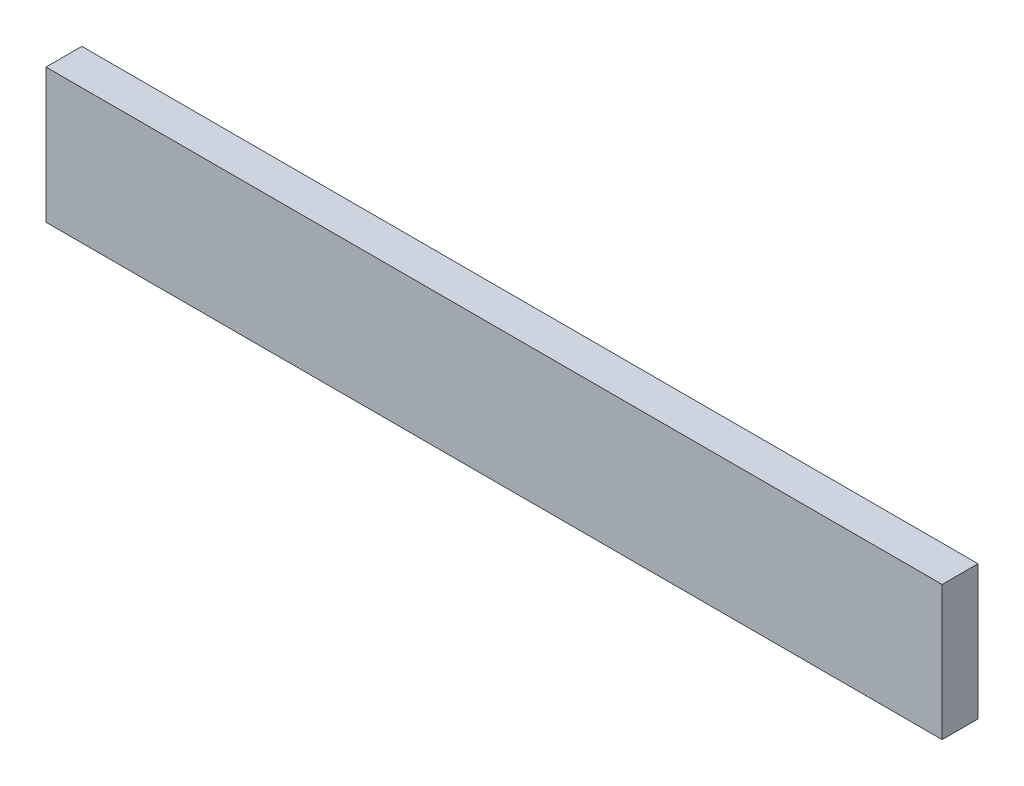
ISO-10303-21;
HEADER;
FILE_DESCRIPTION(('STEP AP214'),'2;1');
FILE_NAME('part.step','',(''),(''),'','','');
FILE_SCHEMA(('AUTOMOTIVE_DESIGN { 1 0 10303 214 1 1 1 1 }'));
ENDSEC;
DATA;
#1=APPLICATION_CONTEXT('core data for automotive mechanical design processes');
#2=APPLICATION_PROTOCOL_DEFINITION('international standard','automotive_design',2000,#1);
#3=PRODUCT_CONTEXT('',#1,'mechanical');
#4=PRODUCT('Part','Part','',(#3));
#5=PRODUCT_RELATED_PRODUCT_CATEGORY('part','',(#4));
#6=PRODUCT_DEFINITION_FORMATION('','',#4);
#7=PRODUCT_DEFINITION_CONTEXT('part definition',#1,'design');
#8=PRODUCT_DEFINITION('design','',#6,#7);
#9=PRODUCT_DEFINITION_SHAPE('','',#8);
#10=(LENGTH_UNIT() NAMED_UNIT(*) SI_UNIT(.MILLI.,.METRE.));
#11=(NAMED_UNIT(*) PLANE_ANGLE_UNIT() SI_UNIT($,.RADIAN.));
#12=(NAMED_UNIT(*) SI_UNIT($,.STERADIAN.) SOLID_ANGLE_UNIT());
#13=UNCERTAINTY_MEASURE_WITH_UNIT(LENGTH_MEASURE(1.E-05),#10,'distance_accuracy_value','');
#14=(GEOMETRIC_REPRESENTATION_CONTEXT(3) GLOBAL_UNCERTAINTY_ASSIGNED_CONTEXT((#13)) GLOBAL_UNIT_ASSIGNED_CONTEXT((#10,
#11,#12)) REPRESENTATION_CONTEXT('',''));
#15=CARTESIAN_POINT('',(0.,0.,0.));
#16=DIRECTION('',(0.,0.,1.));
#17=DIRECTION('',(1.,0.,0.));
#18=AXIS2_PLACEMENT_3D('',#15,#16,#17);
#19=CARTESIAN_POINT('',(0.,0.,0.));
#20=DIRECTION('',(0.,0.,-1.));
#21=DIRECTION('',(-1.,0.,0.));
#22=AXIS2_PLACEMENT_3D('',#19,#20,#21);
#23=PLANE('',#22);
#24=CARTESIAN_POINT('',(48.26,3.81,0.));
#25=DIRECTION('',(0.,0.,-1.));
#26=DIRECTION('',(-1.,0.,0.));
#27=AXIS2_PLACEMENT_3D('',#24,#25,#26);
#28=CIRCLE('',#27,2.54);
#29=CARTESIAN_POINT('',(45.72,3.81,0.));
#30=VERTEX_POINT('',#29);
#31=EDGE_CURVE('E122',#30,#30,#28,.T.);
#32=ORIENTED_EDGE('',*,*,#31,.F.);
#33=EDGE_LOOP('',(#32));
#34=FACE_BOUND('',#33,.T.);
#35=CARTESIAN_POINT('',(109.22,3.81,0.));
#36=DIRECTION('',(0.,0.,-1.));
#37=DIRECTION('',(-1.,0.,0.));
#38=AXIS2_PLACEMENT_3D('',#35,#36,#37);
#39=CIRCLE('',#38,2.54);
#40=CARTESIAN_POINT('',(106.68,3.81,0.));
#41=VERTEX_POINT('',#40);
#42=EDGE_CURVE('E110',#41,#41,#39,.T.);
#43=ORIENTED_EDGE('',*,*,#42,.F.);
#44=EDGE_LOOP('',(#43));
#45=FACE_BOUND('',#44,.T.);
#46=DIRECTION('',(0.,-1.,0.));
#47=VECTOR('',#46,1.);
#48=CARTESIAN_POINT('',(0.,0.,0.));
#49=LINE('',#48,#47);
#50=CARTESIAN_POINT('',(0.,19.05,0.));
#51=VERTEX_POINT('',#50);
#52=CARTESIAN_POINT('',(0.,0.,0.));
#53=VERTEX_POINT('',#52);
#54=EDGE_CURVE('E96',#51,#53,#49,.T.);
#55=ORIENTED_EDGE('',*,*,#54,.F.);
#56=DIRECTION('',(-1.,0.,0.));
#57=VECTOR('',#56,1.);
#58=CARTESIAN_POINT('',(0.,19.05,0.));
#59=LINE('',#58,#57);
#60=CARTESIAN_POINT('',(127.,19.05,0.));
#61=VERTEX_POINT('',#60);
#62=EDGE_CURVE('E72',#61,#51,#59,.T.);
#63=ORIENTED_EDGE('',*,*,#62,.F.);
#64=DIRECTION('',(0.,1.,0.));
#65=VECTOR('',#64,1.);
#66=CARTESIAN_POINT('',(127.,0.,0.));
#67=LINE('',#66,#65);
#68=CARTESIAN_POINT('',(127.,0.,0.));
#69=VERTEX_POINT('',#68);
#70=EDGE_CURVE('E66',#69,#61,#67,.T.);
#71=ORIENTED_EDGE('',*,*,#70,.F.);
#72=DIRECTION('',(1.,0.,0.));
#73=VECTOR('',#72,1.);
#74=CARTESIAN_POINT('',(0.,0.,0.));
#75=LINE('',#74,#73);
#76=EDGE_CURVE('E88',#53,#69,#75,.T.);
#77=ORIENTED_EDGE('',*,*,#76,.F.);
#78=EDGE_LOOP('',(#55,#63,#71,#77));
#79=FACE_BOUND('',#78,.T.);
#80=CARTESIAN_POINT('',(78.74,3.80999999999999,0.));
#81=DIRECTION('',(0.,0.,-1.));
#82=DIRECTION('',(-1.,0.,0.));
#83=AXIS2_PLACEMENT_3D('',#80,#81,#82);
#84=CIRCLE('',#83,2.54);
#85=CARTESIAN_POINT('',(76.2,3.80999999999999,0.));
#86=VERTEX_POINT('',#85);
#87=EDGE_CURVE('E116',#86,#86,#84,.T.);
#88=ORIENTED_EDGE('',*,*,#87,.F.);
#89=EDGE_LOOP('',(#88));
#90=FACE_BOUND('',#89,.T.);
#91=CARTESIAN_POINT('',(17.78,3.81,0.));
#92=DIRECTION('',(0.,0.,-1.));
#93=DIRECTION('',(-1.,0.,0.));
#94=AXIS2_PLACEMENT_3D('',#91,#92,#93);
#95=CIRCLE('',#94,2.54);
#96=CARTESIAN_POINT('',(15.24,3.81,0.));
#97=VERTEX_POINT('',#96);
#98=EDGE_CURVE('E128',#97,#97,#95,.T.);
#99=ORIENTED_EDGE('',*,*,#98,.F.);
#100=EDGE_LOOP('',(#99));
#101=FACE_BOUND('',#100,.T.);
#102=ADVANCED_FACE('F32',(#34,#45,#79,#90,#101),#23,.T.);
#103=CARTESIAN_POINT('',(0.,0.,5.08));
#104=DIRECTION('',(1.,0.,0.));
#105=DIRECTION('',(0.,0.,-1.));
#106=AXIS2_PLACEMENT_3D('',#103,#104,#105);
#107=PLANE('',#106);
#108=ORIENTED_EDGE('',*,*,#54,.T.);
#109=DIRECTION('',(0.,0.,-1.));
#110=VECTOR('',#109,1.);
#111=CARTESIAN_POINT('',(0.,0.,5.08));
#112=LINE('',#111,#110);
#113=CARTESIAN_POINT('',(0.,0.,5.08));
#114=VERTEX_POINT('',#113);
#115=EDGE_CURVE('E11',#114,#53,#112,.T.);
#116=ORIENTED_EDGE('',*,*,#115,.F.);
#117=DIRECTION('',(0.,-1.,0.));
#118=VECTOR('',#117,1.);
#119=CARTESIAN_POINT('',(0.,0.,5.08));
#120=LINE('',#119,#118);
#121=CARTESIAN_POINT('',(0.,19.05,5.08));
#122=VERTEX_POINT('',#121);
#123=EDGE_CURVE('E84',#122,#114,#120,.T.);
#124=ORIENTED_EDGE('',*,*,#123,.F.);
#125=DIRECTION('',(0.,0.,-1.));
#126=VECTOR('',#125,1.);
#127=CARTESIAN_POINT('',(0.,19.05,5.08));
#128=LINE('',#127,#126);
#129=EDGE_CURVE('E92',#122,#51,#128,.T.);
#130=ORIENTED_EDGE('',*,*,#129,.T.);
#131=EDGE_LOOP('',(#108,#116,#124,#130));
#132=FACE_BOUND('',#131,.T.);
#133=ADVANCED_FACE('F34',(#132),#107,.F.);
#134=CARTESIAN_POINT('',(0.,0.,5.08));
#135=DIRECTION('',(0.,1.,0.));
#136=DIRECTION('',(0.,0.,1.));
#137=AXIS2_PLACEMENT_3D('',#134,#135,#136);
#138=PLANE('',#137);
#139=ORIENTED_EDGE('',*,*,#76,.T.);
#140=DIRECTION('',(0.,0.,-1.));
#141=VECTOR('',#140,1.);
#142=CARTESIAN_POINT('',(127.,0.,5.08));
#143=LINE('',#142,#141);
#144=CARTESIAN_POINT('',(127.,0.,5.08));
#145=VERTEX_POINT('',#144);
#146=EDGE_CURVE('E41',#145,#69,#143,.T.);
#147=ORIENTED_EDGE('',*,*,#146,.F.);
#148=DIRECTION('',(1.,0.,0.));
#149=VECTOR('',#148,1.);
#150=CARTESIAN_POINT('',(0.,0.,5.08));
#151=LINE('',#150,#149);
#152=EDGE_CURVE('E79',#114,#145,#151,.T.);
#153=ORIENTED_EDGE('',*,*,#152,.F.);
#154=ORIENTED_EDGE('',*,*,#115,.T.);
#155=EDGE_LOOP('',(#139,#147,#153,#154));
#156=FACE_BOUND('',#155,.T.);
#157=ADVANCED_FACE('F87',(#156),#138,.F.);
#158=CARTESIAN_POINT('',(127.,0.,5.08));
#159=DIRECTION('',(-1.,0.,0.));
#160=DIRECTION('',(0.,0.,1.));
#161=AXIS2_PLACEMENT_3D('',#158,#159,#160);
#162=PLANE('',#161);
#163=ORIENTED_EDGE('',*,*,#70,.T.);
#164=DIRECTION('',(0.,0.,-1.));
#165=VECTOR('',#164,1.);
#166=CARTESIAN_POINT('',(127.,19.05,5.08));
#167=LINE('',#166,#165);
#168=CARTESIAN_POINT('',(127.,19.05,5.08));
#169=VERTEX_POINT('',#168);
#170=EDGE_CURVE('E89',#169,#61,#167,.T.);
#171=ORIENTED_EDGE('',*,*,#170,.F.);
#172=DIRECTION('',(0.,1.,0.));
#173=VECTOR('',#172,1.);
#174=CARTESIAN_POINT('',(127.,0.,5.08));
#175=LINE('',#174,#173);
#176=EDGE_CURVE('E82',#145,#169,#175,.T.);
#177=ORIENTED_EDGE('',*,*,#176,.F.);
#178=ORIENTED_EDGE('',*,*,#146,.T.);
#179=EDGE_LOOP('',(#163,#171,#177,#178));
#180=FACE_BOUND('',#179,.T.);
#181=ADVANCED_FACE('F90',(#180),#162,.F.);
#182=CARTESIAN_POINT('',(0.,19.05,5.08));
#183=DIRECTION('',(0.,-1.,0.));
#184=DIRECTION('',(0.,0.,-1.));
#185=AXIS2_PLACEMENT_3D('',#182,#183,#184);
#186=PLANE('',#185);
#187=ORIENTED_EDGE('',*,*,#62,.T.);
#188=ORIENTED_EDGE('',*,*,#129,.F.);
#189=DIRECTION('',(-1.,0.,0.));
#190=VECTOR('',#189,1.);
#191=CARTESIAN_POINT('',(0.,19.05,5.08));
#192=LINE('',#191,#190);
#193=EDGE_CURVE('E49',#169,#122,#192,.T.);
#194=ORIENTED_EDGE('',*,*,#193,.F.);
#195=ORIENTED_EDGE('',*,*,#170,.T.);
#196=EDGE_LOOP('',(#187,#188,#194,#195));
#197=FACE_BOUND('',#196,.T.);
#198=ADVANCED_FACE('F104',(#197),#186,.F.);
#199=CARTESIAN_POINT('',(0.,0.,5.08));
#200=DIRECTION('',(0.,0.,-1.));
#201=DIRECTION('',(-1.,0.,0.));
#202=AXIS2_PLACEMENT_3D('',#199,#200,#201);
#203=PLANE('',#202);
#204=ORIENTED_EDGE('',*,*,#123,.T.);
#205=ORIENTED_EDGE('',*,*,#152,.T.);
#206=ORIENTED_EDGE('',*,*,#176,.T.);
#207=ORIENTED_EDGE('',*,*,#193,.T.);
#208=EDGE_LOOP('',(#204,#205,#206,#207));
#209=FACE_BOUND('',#208,.T.);
#210=ADVANCED_FACE('F80',(#209),#203,.F.);
#211=CARTESIAN_POINT('',(109.22,3.81,-10.16));
#212=DIRECTION('',(0.,0.,1.));
#213=DIRECTION('',(1.,0.,0.));
#214=AXIS2_PLACEMENT_3D('',#211,#212,#213);
#215=CYLINDRICAL_SURFACE('',#214,2.54);
#216=CARTESIAN_POINT('',(109.22,3.81,-10.16));
#217=DIRECTION('',(0.,0.,-1.));
#218=DIRECTION('',(-1.,0.,0.));
#219=AXIS2_PLACEMENT_3D('',#216,#217,#218);
#220=CIRCLE('',#219,2.54);
#221=CARTESIAN_POINT('',(106.68,3.81,-10.16));
#222=VERTEX_POINT('',#221);
#223=EDGE_CURVE('E99',#222,#222,#220,.T.);
#224=ORIENTED_EDGE('',*,*,#223,.F.);
#225=EDGE_LOOP('',(#224));
#226=FACE_BOUND('',#225,.T.);
#227=ORIENTED_EDGE('',*,*,#42,.T.);
#228=EDGE_LOOP('',(#227));
#229=FACE_BOUND('',#228,.T.);
#230=ADVANCED_FACE('F176',(#226,#229),#215,.T.);
#231=CARTESIAN_POINT('',(109.22,3.81,-10.16));
#232=DIRECTION('',(0.,0.,-1.));
#233=DIRECTION('',(-1.,0.,0.));
#234=AXIS2_PLACEMENT_3D('',#231,#232,#233);
#235=PLANE('',#234);
#236=ORIENTED_EDGE('',*,*,#223,.T.);
#237=EDGE_LOOP('',(#236));
#238=FACE_BOUND('',#237,.T.);
#239=ADVANCED_FACE('F182',(#238),#235,.T.);
#240=CARTESIAN_POINT('',(78.74,3.80999999999999,-10.16));
#241=DIRECTION('',(0.,0.,1.));
#242=DIRECTION('',(1.,0.,0.));
#243=AXIS2_PLACEMENT_3D('',#240,#241,#242);
#244=CYLINDRICAL_SURFACE('',#243,2.54);
#245=CARTESIAN_POINT('',(78.74,3.80999999999999,-10.16));
#246=DIRECTION('',(0.,0.,-1.));
#247=DIRECTION('',(-1.,0.,0.));
#248=AXIS2_PLACEMENT_3D('',#245,#246,#247);
#249=CIRCLE('',#248,2.54);
#250=CARTESIAN_POINT('',(76.2,3.80999999999999,-10.16));
#251=VERTEX_POINT('',#250);
#252=EDGE_CURVE('E113',#251,#251,#249,.T.);
#253=ORIENTED_EDGE('',*,*,#252,.F.);
#254=EDGE_LOOP('',(#253));
#255=FACE_BOUND('',#254,.T.);
#256=ORIENTED_EDGE('',*,*,#87,.T.);
#257=EDGE_LOOP('',(#256));
#258=FACE_BOUND('',#257,.T.);
#259=ADVANCED_FACE('F189',(#255,#258),#244,.T.);
#260=CARTESIAN_POINT('',(78.74,3.80999999999999,-10.16));
#261=DIRECTION('',(0.,0.,-1.));
#262=DIRECTION('',(-1.,0.,0.));
#263=AXIS2_PLACEMENT_3D('',#260,#261,#262);
#264=PLANE('',#263);
#265=ORIENTED_EDGE('',*,*,#252,.T.);
#266=EDGE_LOOP('',(#265));
#267=FACE_BOUND('',#266,.T.);
#268=ADVANCED_FACE('F197',(#267),#264,.T.);
#269=CARTESIAN_POINT('',(48.26,3.81,-10.16));
#270=DIRECTION('',(0.,0.,1.));
#271=DIRECTION('',(1.,0.,0.));
#272=AXIS2_PLACEMENT_3D('',#269,#270,#271);
#273=CYLINDRICAL_SURFACE('',#272,2.54);
#274=CARTESIAN_POINT('',(48.26,3.81,-10.16));
#275=DIRECTION('',(0.,0.,-1.));
#276=DIRECTION('',(-1.,0.,0.));
#277=AXIS2_PLACEMENT_3D('',#274,#275,#276);
#278=CIRCLE('',#277,2.54);
#279=CARTESIAN_POINT('',(45.72,3.81,-10.16));
#280=VERTEX_POINT('',#279);
#281=EDGE_CURVE('E119',#280,#280,#278,.T.);
#282=ORIENTED_EDGE('',*,*,#281,.F.);
#283=EDGE_LOOP('',(#282));
#284=FACE_BOUND('',#283,.T.);
#285=ORIENTED_EDGE('',*,*,#31,.T.);
#286=EDGE_LOOP('',(#285));
#287=FACE_BOUND('',#286,.T.);
#288=ADVANCED_FACE('F205',(#284,#287),#273,.T.);
#289=CARTESIAN_POINT('',(48.26,3.81,-10.16));
#290=DIRECTION('',(0.,0.,-1.));
#291=DIRECTION('',(-1.,0.,0.));
#292=AXIS2_PLACEMENT_3D('',#289,#290,#291);
#293=PLANE('',#292);
#294=ORIENTED_EDGE('',*,*,#281,.T.);
#295=EDGE_LOOP('',(#294));
#296=FACE_BOUND('',#295,.T.);
#297=ADVANCED_FACE('F139',(#296),#293,.T.);
#298=CARTESIAN_POINT('',(17.78,3.81,-10.16));
#299=DIRECTION('',(0.,0.,1.));
#300=DIRECTION('',(1.,0.,0.));
#301=AXIS2_PLACEMENT_3D('',#298,#299,#300);
#302=CYLINDRICAL_SURFACE('',#301,2.54);
#303=CARTESIAN_POINT('',(17.78,3.81,-10.16));
#304=DIRECTION('',(0.,0.,-1.));
#305=DIRECTION('',(-1.,0.,0.));
#306=AXIS2_PLACEMENT_3D('',#303,#304,#305);
#307=CIRCLE('',#306,2.54);
#308=CARTESIAN_POINT('',(15.24,3.81,-10.16));
#309=VERTEX_POINT('',#308);
#310=EDGE_CURVE('E125',#309,#309,#307,.T.);
#311=ORIENTED_EDGE('',*,*,#310,.F.);
#312=EDGE_LOOP('',(#311));
#313=FACE_BOUND('',#312,.T.);
#314=ORIENTED_EDGE('',*,*,#98,.T.);
#315=EDGE_LOOP('',(#314));
#316=FACE_BOUND('',#315,.T.);
#317=ADVANCED_FACE('F136',(#313,#316),#302,.T.);
#318=CARTESIAN_POINT('',(17.78,3.81,-10.16));
#319=DIRECTION('',(0.,0.,-1.));
#320=DIRECTION('',(-1.,0.,0.));
#321=AXIS2_PLACEMENT_3D('',#318,#319,#320);
#322=PLANE('',#321);
#323=ORIENTED_EDGE('',*,*,#310,.T.);
#324=EDGE_LOOP('',(#323));
#325=FACE_BOUND('',#324,.T.);
#326=ADVANCED_FACE('F134',(#325),#322,.T.);
#327=CLOSED_SHELL('',(#102,#133,#157,#181,#198,#210,#230,#239,#259,#268,#288,#297,#317,#326));
#328=MANIFOLD_SOLID_BREP('B2',#327);
#329=ADVANCED_BREP_SHAPE_REPRESENTATION('',(#18,#328),#14);
#330=SHAPE_DEFINITION_REPRESENTATION(#9,#329);
ENDSEC;
END-ISO-10303-21;
